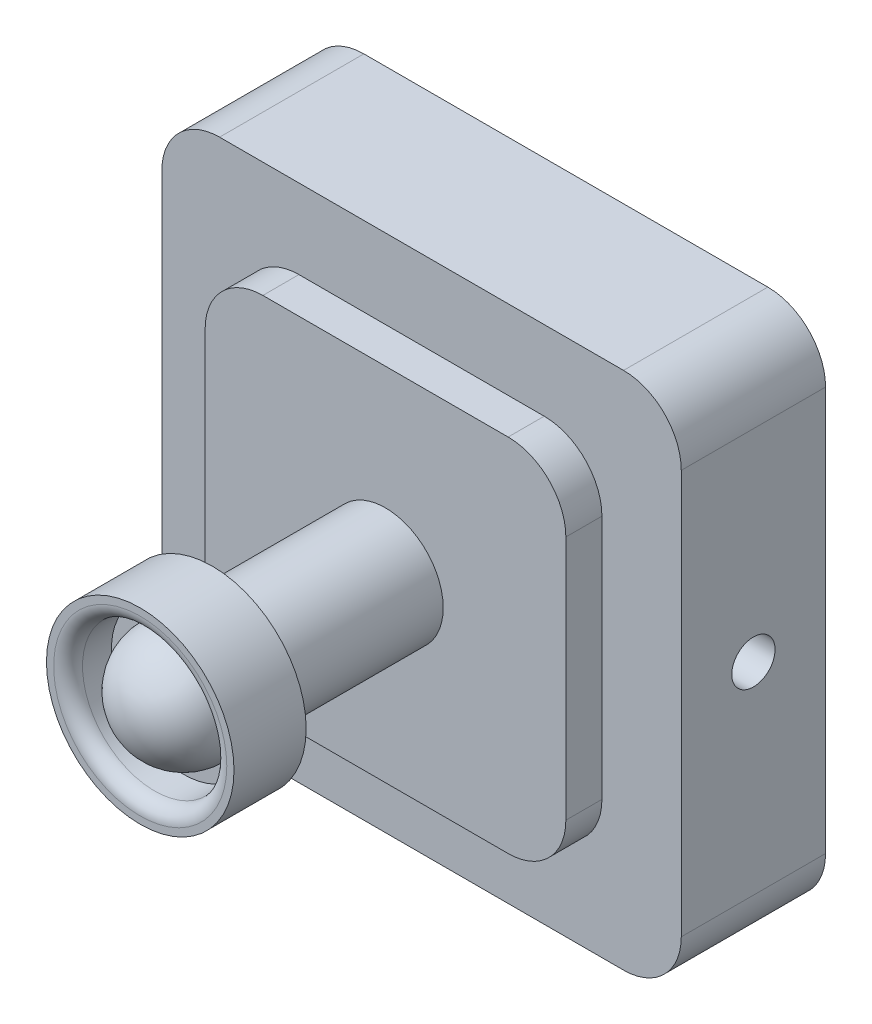
ISO-10303-21;
HEADER;
FILE_DESCRIPTION(('STEP AP214'),'2;1');
FILE_NAME('part.step','',(''),(''),'','','');
FILE_SCHEMA(('AUTOMOTIVE_DESIGN { 1 0 10303 214 1 1 1 1 }'));
ENDSEC;
DATA;
#1=APPLICATION_CONTEXT('core data for automotive mechanical design processes');
#2=APPLICATION_PROTOCOL_DEFINITION('international standard','automotive_design',2000,#1);
#3=PRODUCT_CONTEXT('',#1,'mechanical');
#4=PRODUCT('Part','Part','',(#3));
#5=PRODUCT_RELATED_PRODUCT_CATEGORY('part','',(#4));
#6=PRODUCT_DEFINITION_FORMATION('','',#4);
#7=PRODUCT_DEFINITION_CONTEXT('part definition',#1,'design');
#8=PRODUCT_DEFINITION('design','',#6,#7);
#9=PRODUCT_DEFINITION_SHAPE('','',#8);
#10=(LENGTH_UNIT() NAMED_UNIT(*) SI_UNIT(.MILLI.,.METRE.));
#11=(NAMED_UNIT(*) PLANE_ANGLE_UNIT() SI_UNIT($,.RADIAN.));
#12=(NAMED_UNIT(*) SI_UNIT($,.STERADIAN.) SOLID_ANGLE_UNIT());
#13=UNCERTAINTY_MEASURE_WITH_UNIT(LENGTH_MEASURE(1.E-05),#10,'distance_accuracy_value','');
#14=(GEOMETRIC_REPRESENTATION_CONTEXT(3) GLOBAL_UNCERTAINTY_ASSIGNED_CONTEXT((#13)) GLOBAL_UNIT_ASSIGNED_CONTEXT((#10,
#11,#12)) REPRESENTATION_CONTEXT('',''));
#15=CARTESIAN_POINT('',(0.,0.,0.));
#16=DIRECTION('',(0.,0.,1.));
#17=DIRECTION('',(1.,0.,0.));
#18=AXIS2_PLACEMENT_3D('',#15,#16,#17);
#19=CARTESIAN_POINT('',(0.,0.,10.));
#20=DIRECTION('',(0.,0.,-1.));
#21=DIRECTION('',(-1.,0.,0.));
#22=AXIS2_PLACEMENT_3D('',#19,#20,#21);
#23=PLANE('',#22);
#24=DIRECTION('',(-1.,0.,0.));
#25=VECTOR('',#24,1.);
#26=CARTESIAN_POINT('',(0.,36.,10.));
#27=LINE('',#26,#25);
#28=CARTESIAN_POINT('',(32.,36.,10.));
#29=VERTEX_POINT('',#28);
#30=CARTESIAN_POINT('',(4.,36.,10.));
#31=VERTEX_POINT('',#30);
#32=EDGE_CURVE('E195',#29,#31,#27,.T.);
#33=ORIENTED_EDGE('',*,*,#32,.T.);
#34=CARTESIAN_POINT('',(4.,32.,10.));
#35=DIRECTION('',(0.,0.,-1.));
#36=DIRECTION('',(-1.,0.,0.));
#37=AXIS2_PLACEMENT_3D('',#34,#35,#36);
#38=CIRCLE('',#37,4.);
#39=CARTESIAN_POINT('',(0.,32.,10.));
#40=VERTEX_POINT('',#39);
#41=EDGE_CURVE('E263',#31,#40,#38,.F.);
#42=ORIENTED_EDGE('',*,*,#41,.T.);
#43=DIRECTION('',(0.,-1.,0.));
#44=VECTOR('',#43,1.);
#45=CARTESIAN_POINT('',(0.,0.,10.));
#46=LINE('',#45,#44);
#47=CARTESIAN_POINT('',(0.,4.,10.));
#48=VERTEX_POINT('',#47);
#49=EDGE_CURVE('E187',#40,#48,#46,.T.);
#50=ORIENTED_EDGE('',*,*,#49,.T.);
#51=CARTESIAN_POINT('',(4.,4.,10.));
#52=DIRECTION('',(0.,0.,-1.));
#53=DIRECTION('',(-1.,0.,0.));
#54=AXIS2_PLACEMENT_3D('',#51,#52,#53);
#55=CIRCLE('',#54,4.);
#56=CARTESIAN_POINT('',(4.,0.,10.));
#57=VERTEX_POINT('',#56);
#58=EDGE_CURVE('E258',#48,#57,#55,.F.);
#59=ORIENTED_EDGE('',*,*,#58,.T.);
#60=DIRECTION('',(1.,0.,0.));
#61=VECTOR('',#60,1.);
#62=CARTESIAN_POINT('',(0.,0.,10.));
#63=LINE('',#62,#61);
#64=CARTESIAN_POINT('',(32.,0.,10.));
#65=VERTEX_POINT('',#64);
#66=EDGE_CURVE('E190',#57,#65,#63,.T.);
#67=ORIENTED_EDGE('',*,*,#66,.T.);
#68=CARTESIAN_POINT('',(32.,4.,10.));
#69=DIRECTION('',(0.,0.,-1.));
#70=DIRECTION('',(-1.,0.,0.));
#71=AXIS2_PLACEMENT_3D('',#68,#69,#70);
#72=CIRCLE('',#71,4.);
#73=CARTESIAN_POINT('',(36.,4.,10.));
#74=VERTEX_POINT('',#73);
#75=EDGE_CURVE('E57',#65,#74,#72,.F.);
#76=ORIENTED_EDGE('',*,*,#75,.T.);
#77=DIRECTION('',(0.,1.,0.));
#78=VECTOR('',#77,1.);
#79=CARTESIAN_POINT('',(36.,0.,10.));
#80=LINE('',#79,#78);
#81=CARTESIAN_POINT('',(36.,32.,10.));
#82=VERTEX_POINT('',#81);
#83=EDGE_CURVE('E193',#74,#82,#80,.T.);
#84=ORIENTED_EDGE('',*,*,#83,.T.);
#85=CARTESIAN_POINT('',(32.,32.,10.));
#86=DIRECTION('',(0.,0.,-1.));
#87=DIRECTION('',(-1.,0.,0.));
#88=AXIS2_PLACEMENT_3D('',#85,#86,#87);
#89=CIRCLE('',#88,4.);
#90=EDGE_CURVE('E261',#82,#29,#89,.F.);
#91=ORIENTED_EDGE('',*,*,#90,.T.);
#92=EDGE_LOOP('',(#33,#42,#50,#59,#67,#76,#84,#91));
#93=FACE_BOUND('',#92,.T.);
#94=DIRECTION('',(0.,1.,0.));
#95=VECTOR('',#94,1.);
#96=CARTESIAN_POINT('',(30.5,30.5,10.));
#97=LINE('',#96,#95);
#98=CARTESIAN_POINT('',(30.5,9.50000000000001,10.));
#99=VERTEX_POINT('',#98);
#100=CARTESIAN_POINT('',(30.5,26.5,10.));
#101=VERTEX_POINT('',#100);
#102=EDGE_CURVE('E183',#99,#101,#97,.T.);
#103=ORIENTED_EDGE('',*,*,#102,.F.);
#104=CARTESIAN_POINT('',(26.5,9.50000000000001,10.));
#105=DIRECTION('',(0.,0.,-1.));
#106=DIRECTION('',(-1.,0.,0.));
#107=AXIS2_PLACEMENT_3D('',#104,#105,#106);
#108=CIRCLE('',#107,4.);
#109=CARTESIAN_POINT('',(26.5,5.50000000000001,10.));
#110=VERTEX_POINT('',#109);
#111=EDGE_CURVE('E238',#99,#110,#108,.T.);
#112=ORIENTED_EDGE('',*,*,#111,.T.);
#113=DIRECTION('',(1.,0.,0.));
#114=VECTOR('',#113,1.);
#115=CARTESIAN_POINT('',(5.5,5.50000000000001,10.));
#116=LINE('',#115,#114);
#117=CARTESIAN_POINT('',(9.50000000000001,5.50000000000001,10.));
#118=VERTEX_POINT('',#117);
#119=EDGE_CURVE('E177',#118,#110,#116,.T.);
#120=ORIENTED_EDGE('',*,*,#119,.F.);
#121=CARTESIAN_POINT('',(9.50000000000001,9.50000000000001,10.));
#122=DIRECTION('',(0.,0.,-1.));
#123=DIRECTION('',(-1.,0.,0.));
#124=AXIS2_PLACEMENT_3D('',#121,#122,#123);
#125=CIRCLE('',#124,4.);
#126=CARTESIAN_POINT('',(5.5,9.50000000000001,10.));
#127=VERTEX_POINT('',#126);
#128=EDGE_CURVE('E176',#118,#127,#125,.T.);
#129=ORIENTED_EDGE('',*,*,#128,.T.);
#130=DIRECTION('',(0.,-1.,0.));
#131=VECTOR('',#130,1.);
#132=CARTESIAN_POINT('',(5.5,30.5,10.));
#133=LINE('',#132,#131);
#134=CARTESIAN_POINT('',(5.5,26.5,10.));
#135=VERTEX_POINT('',#134);
#136=EDGE_CURVE('E167',#135,#127,#133,.T.);
#137=ORIENTED_EDGE('',*,*,#136,.F.);
#138=CARTESIAN_POINT('',(9.5,26.5,10.));
#139=DIRECTION('',(0.,0.,-1.));
#140=DIRECTION('',(-1.,0.,0.));
#141=AXIS2_PLACEMENT_3D('',#138,#139,#140);
#142=CIRCLE('',#141,4.);
#143=CARTESIAN_POINT('',(9.5,30.5,10.));
#144=VERTEX_POINT('',#143);
#145=EDGE_CURVE('E150',#135,#144,#142,.T.);
#146=ORIENTED_EDGE('',*,*,#145,.T.);
#147=DIRECTION('',(-1.,0.,0.));
#148=VECTOR('',#147,1.);
#149=CARTESIAN_POINT('',(5.5,30.5,10.));
#150=LINE('',#149,#148);
#151=CARTESIAN_POINT('',(26.5,30.5,10.));
#152=VERTEX_POINT('',#151);
#153=EDGE_CURVE('E178',#152,#144,#150,.T.);
#154=ORIENTED_EDGE('',*,*,#153,.F.);
#155=CARTESIAN_POINT('',(26.5,26.5,10.));
#156=DIRECTION('',(0.,0.,-1.));
#157=DIRECTION('',(-1.,0.,0.));
#158=AXIS2_PLACEMENT_3D('',#155,#156,#157);
#159=CIRCLE('',#158,4.);
#160=EDGE_CURVE('E160',#152,#101,#159,.T.);
#161=ORIENTED_EDGE('',*,*,#160,.T.);
#162=EDGE_LOOP('',(#103,#112,#120,#129,#137,#146,#154,#161));
#163=FACE_BOUND('',#162,.T.);
#164=ADVANCED_FACE('F35',(#93,#163),#23,.F.);
#165=CARTESIAN_POINT('',(0.,0.,10.));
#166=DIRECTION('',(1.,0.,0.));
#167=DIRECTION('',(0.,0.,-1.));
#168=AXIS2_PLACEMENT_3D('',#165,#166,#167);
#169=PLANE('',#168);
#170=CARTESIAN_POINT('',(0.,18.,5.));
#171=DIRECTION('',(-1.,0.,0.));
#172=DIRECTION('',(0.,0.,1.));
#173=AXIS2_PLACEMENT_3D('',#170,#171,#172);
#174=CIRCLE('',#173,1.5);
#175=CARTESIAN_POINT('',(0.,18.,6.5));
#176=VERTEX_POINT('',#175);
#177=EDGE_CURVE('E462',#176,#176,#174,.T.);
#178=ORIENTED_EDGE('',*,*,#177,.F.);
#179=EDGE_LOOP('',(#178));
#180=FACE_BOUND('',#179,.T.);
#181=ORIENTED_EDGE('',*,*,#49,.F.);
#182=DIRECTION('',(0.,0.,-1.));
#183=VECTOR('',#182,1.);
#184=CARTESIAN_POINT('',(0.,32.,10.));
#185=LINE('',#184,#183);
#186=CARTESIAN_POINT('',(0.,32.,0.));
#187=VERTEX_POINT('',#186);
#188=EDGE_CURVE('E242',#40,#187,#185,.T.);
#189=ORIENTED_EDGE('',*,*,#188,.T.);
#190=DIRECTION('',(0.,-1.,0.));
#191=VECTOR('',#190,1.);
#192=CARTESIAN_POINT('',(0.,0.,0.));
#193=LINE('',#192,#191);
#194=CARTESIAN_POINT('',(0.,4.,0.));
#195=VERTEX_POINT('',#194);
#196=EDGE_CURVE('E199',#187,#195,#193,.T.);
#197=ORIENTED_EDGE('',*,*,#196,.T.);
#198=DIRECTION('',(0.,0.,-1.));
#199=VECTOR('',#198,1.);
#200=CARTESIAN_POINT('',(0.,4.,10.));
#201=LINE('',#200,#199);
#202=EDGE_CURVE('E240',#195,#48,#201,.F.);
#203=ORIENTED_EDGE('',*,*,#202,.T.);
#204=EDGE_LOOP('',(#181,#189,#197,#203));
#205=FACE_BOUND('',#204,.T.);
#206=ADVANCED_FACE('F290',(#180,#205),#169,.F.);
#207=CARTESIAN_POINT('',(0.,0.,10.));
#208=DIRECTION('',(0.,1.,0.));
#209=DIRECTION('',(0.,0.,1.));
#210=AXIS2_PLACEMENT_3D('',#207,#208,#209);
#211=PLANE('',#210);
#212=DIRECTION('',(1.,0.,0.));
#213=VECTOR('',#212,1.);
#214=CARTESIAN_POINT('',(0.,0.,0.));
#215=LINE('',#214,#213);
#216=CARTESIAN_POINT('',(4.,0.,0.));
#217=VERTEX_POINT('',#216);
#218=CARTESIAN_POINT('',(32.,0.,0.));
#219=VERTEX_POINT('',#218);
#220=EDGE_CURVE('E202',#217,#219,#215,.T.);
#221=ORIENTED_EDGE('',*,*,#220,.T.);
#222=DIRECTION('',(0.,0.,-1.));
#223=VECTOR('',#222,1.);
#224=CARTESIAN_POINT('',(32.,0.,10.));
#225=LINE('',#224,#223);
#226=EDGE_CURVE('E272',#219,#65,#225,.F.);
#227=ORIENTED_EDGE('',*,*,#226,.T.);
#228=ORIENTED_EDGE('',*,*,#66,.F.);
#229=DIRECTION('',(0.,0.,-1.));
#230=VECTOR('',#229,1.);
#231=CARTESIAN_POINT('',(4.,0.,10.));
#232=LINE('',#231,#230);
#233=EDGE_CURVE('E269',#57,#217,#232,.T.);
#234=ORIENTED_EDGE('',*,*,#233,.T.);
#235=EDGE_LOOP('',(#221,#227,#228,#234));
#236=FACE_BOUND('',#235,.T.);
#237=ADVANCED_FACE('F295',(#236),#211,.F.);
#238=CARTESIAN_POINT('',(36.,0.,10.));
#239=DIRECTION('',(-1.,0.,0.));
#240=DIRECTION('',(0.,0.,1.));
#241=AXIS2_PLACEMENT_3D('',#238,#239,#240);
#242=PLANE('',#241);
#243=CARTESIAN_POINT('',(36.,18.,5.));
#244=DIRECTION('',(1.,0.,0.));
#245=DIRECTION('',(0.,0.,-1.));
#246=AXIS2_PLACEMENT_3D('',#243,#244,#245);
#247=CIRCLE('',#246,1.5);
#248=CARTESIAN_POINT('',(36.,18.,3.5));
#249=VERTEX_POINT('',#248);
#250=EDGE_CURVE('E456',#249,#249,#247,.T.);
#251=ORIENTED_EDGE('',*,*,#250,.F.);
#252=EDGE_LOOP('',(#251));
#253=FACE_BOUND('',#252,.T.);
#254=DIRECTION('',(0.,1.,0.));
#255=VECTOR('',#254,1.);
#256=CARTESIAN_POINT('',(36.,0.,0.));
#257=LINE('',#256,#255);
#258=CARTESIAN_POINT('',(36.,4.,0.));
#259=VERTEX_POINT('',#258);
#260=CARTESIAN_POINT('',(36.,32.,0.));
#261=VERTEX_POINT('',#260);
#262=EDGE_CURVE('E206',#259,#261,#257,.T.);
#263=ORIENTED_EDGE('',*,*,#262,.T.);
#264=DIRECTION('',(0.,0.,-1.));
#265=VECTOR('',#264,1.);
#266=CARTESIAN_POINT('',(36.,32.,10.));
#267=LINE('',#266,#265);
#268=EDGE_CURVE('E50',#261,#82,#267,.F.);
#269=ORIENTED_EDGE('',*,*,#268,.T.);
#270=ORIENTED_EDGE('',*,*,#83,.F.);
#271=DIRECTION('',(0.,0.,-1.));
#272=VECTOR('',#271,1.);
#273=CARTESIAN_POINT('',(36.,4.,10.));
#274=LINE('',#273,#272);
#275=EDGE_CURVE('E265',#74,#259,#274,.T.);
#276=ORIENTED_EDGE('',*,*,#275,.T.);
#277=EDGE_LOOP('',(#263,#269,#270,#276));
#278=FACE_BOUND('',#277,.T.);
#279=ADVANCED_FACE('F309',(#253,#278),#242,.F.);
#280=CARTESIAN_POINT('',(0.,36.,10.));
#281=DIRECTION('',(0.,-1.,0.));
#282=DIRECTION('',(1.,0.,0.));
#283=AXIS2_PLACEMENT_3D('',#280,#281,#282);
#284=PLANE('',#283);
#285=DIRECTION('',(-1.,0.,0.));
#286=VECTOR('',#285,1.);
#287=CARTESIAN_POINT('',(0.,36.,0.));
#288=LINE('',#287,#286);
#289=CARTESIAN_POINT('',(32.,36.,0.));
#290=VERTEX_POINT('',#289);
#291=CARTESIAN_POINT('',(4.,36.,0.));
#292=VERTEX_POINT('',#291);
#293=EDGE_CURVE('E191',#290,#292,#288,.T.);
#294=ORIENTED_EDGE('',*,*,#293,.T.);
#295=DIRECTION('',(0.,0.,-1.));
#296=VECTOR('',#295,1.);
#297=CARTESIAN_POINT('',(4.,36.,10.));
#298=LINE('',#297,#296);
#299=EDGE_CURVE('E256',#292,#31,#298,.F.);
#300=ORIENTED_EDGE('',*,*,#299,.T.);
#301=ORIENTED_EDGE('',*,*,#32,.F.);
#302=DIRECTION('',(0.,0.,-1.));
#303=VECTOR('',#302,1.);
#304=CARTESIAN_POINT('',(32.,36.,10.));
#305=LINE('',#304,#303);
#306=EDGE_CURVE('E253',#29,#290,#305,.T.);
#307=ORIENTED_EDGE('',*,*,#306,.T.);
#308=EDGE_LOOP('',(#294,#300,#301,#307));
#309=FACE_BOUND('',#308,.T.);
#310=ADVANCED_FACE('F305',(#309),#284,.F.);
#311=CARTESIAN_POINT('',(0.,0.,0.));
#312=DIRECTION('',(0.,0.,-1.));
#313=DIRECTION('',(-1.,0.,0.));
#314=AXIS2_PLACEMENT_3D('',#311,#312,#313);
#315=PLANE('',#314);
#316=ORIENTED_EDGE('',*,*,#196,.F.);
#317=CARTESIAN_POINT('',(4.,32.,0.));
#318=DIRECTION('',(0.,0.,-1.));
#319=DIRECTION('',(-1.,0.,0.));
#320=AXIS2_PLACEMENT_3D('',#317,#318,#319);
#321=CIRCLE('',#320,4.);
#322=EDGE_CURVE('E251',#187,#292,#321,.T.);
#323=ORIENTED_EDGE('',*,*,#322,.T.);
#324=ORIENTED_EDGE('',*,*,#293,.F.);
#325=CARTESIAN_POINT('',(32.,32.,0.));
#326=DIRECTION('',(0.,0.,-1.));
#327=DIRECTION('',(-1.,0.,0.));
#328=AXIS2_PLACEMENT_3D('',#325,#326,#327);
#329=CIRCLE('',#328,4.);
#330=EDGE_CURVE('E249',#290,#261,#329,.T.);
#331=ORIENTED_EDGE('',*,*,#330,.T.);
#332=ORIENTED_EDGE('',*,*,#262,.F.);
#333=CARTESIAN_POINT('',(32.,4.,0.));
#334=DIRECTION('',(0.,0.,-1.));
#335=DIRECTION('',(-1.,0.,0.));
#336=AXIS2_PLACEMENT_3D('',#333,#334,#335);
#337=CIRCLE('',#336,4.);
#338=EDGE_CURVE('E247',#259,#219,#337,.T.);
#339=ORIENTED_EDGE('',*,*,#338,.T.);
#340=ORIENTED_EDGE('',*,*,#220,.F.);
#341=CARTESIAN_POINT('',(4.,4.,0.));
#342=DIRECTION('',(0.,0.,-1.));
#343=DIRECTION('',(-1.,0.,0.));
#344=AXIS2_PLACEMENT_3D('',#341,#342,#343);
#345=CIRCLE('',#344,4.);
#346=EDGE_CURVE('E245',#217,#195,#345,.T.);
#347=ORIENTED_EDGE('',*,*,#346,.T.);
#348=EDGE_LOOP('',(#316,#323,#324,#331,#332,#339,#340,#347));
#349=FACE_BOUND('',#348,.T.);
#350=ADVANCED_FACE('F302',(#349),#315,.T.);
#351=CARTESIAN_POINT('',(30.5,30.5,12.5));
#352=DIRECTION('',(-1.,0.,0.));
#353=DIRECTION('',(0.,-1.,0.));
#354=AXIS2_PLACEMENT_3D('',#351,#352,#353);
#355=PLANE('',#354);
#356=ORIENTED_EDGE('',*,*,#102,.T.);
#357=DIRECTION('',(0.,0.,-1.));
#358=VECTOR('',#357,1.);
#359=CARTESIAN_POINT('',(30.5,26.5,12.5));
#360=LINE('',#359,#358);
#361=CARTESIAN_POINT('',(30.5,26.5,12.5));
#362=VERTEX_POINT('',#361);
#363=EDGE_CURVE('E230',#101,#362,#360,.F.);
#364=ORIENTED_EDGE('',*,*,#363,.T.);
#365=DIRECTION('',(0.,1.,0.));
#366=VECTOR('',#365,1.);
#367=CARTESIAN_POINT('',(30.5,30.5,12.5));
#368=LINE('',#367,#366);
#369=CARTESIAN_POINT('',(30.5,9.50000000000001,12.5));
#370=VERTEX_POINT('',#369);
#371=EDGE_CURVE('E181',#370,#362,#368,.T.);
#372=ORIENTED_EDGE('',*,*,#371,.F.);
#373=DIRECTION('',(0.,0.,-1.));
#374=VECTOR('',#373,1.);
#375=CARTESIAN_POINT('',(30.5,9.50000000000001,12.5));
#376=LINE('',#375,#374);
#377=EDGE_CURVE('E227',#370,#99,#376,.T.);
#378=ORIENTED_EDGE('',*,*,#377,.T.);
#379=EDGE_LOOP('',(#356,#364,#372,#378));
#380=FACE_BOUND('',#379,.T.);
#381=ADVANCED_FACE('F300',(#380),#355,.F.);
#382=CARTESIAN_POINT('',(5.5,30.5,12.5));
#383=DIRECTION('',(0.,-1.,0.));
#384=DIRECTION('',(0.,0.,-1.));
#385=AXIS2_PLACEMENT_3D('',#382,#383,#384);
#386=PLANE('',#385);
#387=ORIENTED_EDGE('',*,*,#153,.T.);
#388=DIRECTION('',(0.,0.,-1.));
#389=VECTOR('',#388,1.);
#390=CARTESIAN_POINT('',(9.5,30.5,12.5));
#391=LINE('',#390,#389);
#392=CARTESIAN_POINT('',(9.5,30.5,12.5));
#393=VERTEX_POINT('',#392);
#394=EDGE_CURVE('E155',#144,#393,#391,.F.);
#395=ORIENTED_EDGE('',*,*,#394,.T.);
#396=DIRECTION('',(-1.,0.,0.));
#397=VECTOR('',#396,1.);
#398=CARTESIAN_POINT('',(5.5,30.5,12.5));
#399=LINE('',#398,#397);
#400=CARTESIAN_POINT('',(26.5,30.5,12.5));
#401=VERTEX_POINT('',#400);
#402=EDGE_CURVE('E432',#401,#393,#399,.T.);
#403=ORIENTED_EDGE('',*,*,#402,.F.);
#404=DIRECTION('',(0.,0.,-1.));
#405=VECTOR('',#404,1.);
#406=CARTESIAN_POINT('',(26.5,30.5,12.5));
#407=LINE('',#406,#405);
#408=EDGE_CURVE('E171',#401,#152,#407,.T.);
#409=ORIENTED_EDGE('',*,*,#408,.T.);
#410=EDGE_LOOP('',(#387,#395,#403,#409));
#411=FACE_BOUND('',#410,.T.);
#412=ADVANCED_FACE('F414',(#411),#386,.F.);
#413=CARTESIAN_POINT('',(5.5,30.5,12.5));
#414=DIRECTION('',(1.,0.,0.));
#415=DIRECTION('',(0.,1.,0.));
#416=AXIS2_PLACEMENT_3D('',#413,#414,#415);
#417=PLANE('',#416);
#418=DIRECTION('',(0.,-1.,0.));
#419=VECTOR('',#418,1.);
#420=CARTESIAN_POINT('',(5.5,30.5,12.5));
#421=LINE('',#420,#419);
#422=CARTESIAN_POINT('',(5.5,26.5,12.5));
#423=VERTEX_POINT('',#422);
#424=CARTESIAN_POINT('',(5.5,9.50000000000001,12.5));
#425=VERTEX_POINT('',#424);
#426=EDGE_CURVE('E170',#423,#425,#421,.T.);
#427=ORIENTED_EDGE('',*,*,#426,.F.);
#428=DIRECTION('',(0.,0.,-1.));
#429=VECTOR('',#428,1.);
#430=CARTESIAN_POINT('',(5.5,26.5,12.5));
#431=LINE('',#430,#429);
#432=EDGE_CURVE('E154',#423,#135,#431,.T.);
#433=ORIENTED_EDGE('',*,*,#432,.T.);
#434=ORIENTED_EDGE('',*,*,#136,.T.);
#435=DIRECTION('',(0.,0.,-1.));
#436=VECTOR('',#435,1.);
#437=CARTESIAN_POINT('',(5.5,9.50000000000001,12.5));
#438=LINE('',#437,#436);
#439=EDGE_CURVE('E172',#127,#425,#438,.F.);
#440=ORIENTED_EDGE('',*,*,#439,.T.);
#441=EDGE_LOOP('',(#427,#433,#434,#440));
#442=FACE_BOUND('',#441,.T.);
#443=ADVANCED_FACE('F166',(#442),#417,.F.);
#444=CARTESIAN_POINT('',(5.5,5.50000000000001,12.5));
#445=DIRECTION('',(0.,1.,0.));
#446=DIRECTION('',(0.,0.,1.));
#447=AXIS2_PLACEMENT_3D('',#444,#445,#446);
#448=PLANE('',#447);
#449=DIRECTION('',(1.,0.,0.));
#450=VECTOR('',#449,1.);
#451=CARTESIAN_POINT('',(5.5,5.50000000000001,12.5));
#452=LINE('',#451,#450);
#453=CARTESIAN_POINT('',(9.50000000000001,5.50000000000001,12.5));
#454=VERTEX_POINT('',#453);
#455=CARTESIAN_POINT('',(26.5,5.50000000000001,12.5));
#456=VERTEX_POINT('',#455);
#457=EDGE_CURVE('E203',#454,#456,#452,.T.);
#458=ORIENTED_EDGE('',*,*,#457,.F.);
#459=DIRECTION('',(0.,0.,-1.));
#460=VECTOR('',#459,1.);
#461=CARTESIAN_POINT('',(9.50000000000001,5.50000000000001,12.5));
#462=LINE('',#461,#460);
#463=EDGE_CURVE('E161',#454,#118,#462,.T.);
#464=ORIENTED_EDGE('',*,*,#463,.T.);
#465=ORIENTED_EDGE('',*,*,#119,.T.);
#466=DIRECTION('',(0.,0.,-1.));
#467=VECTOR('',#466,1.);
#468=CARTESIAN_POINT('',(26.5,5.50000000000001,12.5));
#469=LINE('',#468,#467);
#470=EDGE_CURVE('E232',#110,#456,#469,.F.);
#471=ORIENTED_EDGE('',*,*,#470,.T.);
#472=EDGE_LOOP('',(#458,#464,#465,#471));
#473=FACE_BOUND('',#472,.T.);
#474=ADVANCED_FACE('F408',(#473),#448,.F.);
#475=CARTESIAN_POINT('',(0.,0.,12.5));
#476=DIRECTION('',(0.,0.,1.));
#477=DIRECTION('',(1.,0.,0.));
#478=AXIS2_PLACEMENT_3D('',#475,#476,#477);
#479=PLANE('',#478);
#480=CARTESIAN_POINT('',(18.,18.,12.5));
#481=DIRECTION('',(0.,0.,1.));
#482=DIRECTION('',(1.,0.,0.));
#483=AXIS2_PLACEMENT_3D('',#480,#481,#482);
#484=CIRCLE('',#483,4.);
#485=CARTESIAN_POINT('',(22.,18.,12.5));
#486=VERTEX_POINT('',#485);
#487=EDGE_CURVE('E198',#486,#486,#484,.T.);
#488=ORIENTED_EDGE('',*,*,#487,.F.);
#489=EDGE_LOOP('',(#488));
#490=FACE_BOUND('',#489,.T.);
#491=ORIENTED_EDGE('',*,*,#402,.T.);
#492=CARTESIAN_POINT('',(9.5,26.5,12.5));
#493=DIRECTION('',(0.,0.,1.));
#494=DIRECTION('',(1.,0.,0.));
#495=AXIS2_PLACEMENT_3D('',#492,#493,#494);
#496=CIRCLE('',#495,4.);
#497=EDGE_CURVE('E225',#393,#423,#496,.T.);
#498=ORIENTED_EDGE('',*,*,#497,.T.);
#499=ORIENTED_EDGE('',*,*,#426,.T.);
#500=CARTESIAN_POINT('',(9.50000000000001,9.50000000000001,12.5));
#501=DIRECTION('',(0.,0.,1.));
#502=DIRECTION('',(1.,0.,0.));
#503=AXIS2_PLACEMENT_3D('',#500,#501,#502);
#504=CIRCLE('',#503,4.);
#505=EDGE_CURVE('E221',#425,#454,#504,.T.);
#506=ORIENTED_EDGE('',*,*,#505,.T.);
#507=ORIENTED_EDGE('',*,*,#457,.T.);
#508=CARTESIAN_POINT('',(26.5,9.50000000000001,12.5));
#509=DIRECTION('',(0.,0.,1.));
#510=DIRECTION('',(1.,0.,0.));
#511=AXIS2_PLACEMENT_3D('',#508,#509,#510);
#512=CIRCLE('',#511,4.);
#513=EDGE_CURVE('E219',#456,#370,#512,.T.);
#514=ORIENTED_EDGE('',*,*,#513,.T.);
#515=ORIENTED_EDGE('',*,*,#371,.T.);
#516=CARTESIAN_POINT('',(26.5,26.5,12.5));
#517=DIRECTION('',(0.,0.,1.));
#518=DIRECTION('',(1.,0.,0.));
#519=AXIS2_PLACEMENT_3D('',#516,#517,#518);
#520=CIRCLE('',#519,4.);
#521=EDGE_CURVE('E223',#362,#401,#520,.T.);
#522=ORIENTED_EDGE('',*,*,#521,.T.);
#523=EDGE_LOOP('',(#491,#498,#499,#506,#507,#514,#515,#522));
#524=FACE_BOUND('',#523,.T.);
#525=ADVANCED_FACE('F404',(#490,#524),#479,.T.);
#526=CARTESIAN_POINT('',(18.,18.,24.5));
#527=DIRECTION('',(0.,0.,-1.));
#528=DIRECTION('',(-1.,0.,0.));
#529=AXIS2_PLACEMENT_3D('',#526,#527,#528);
#530=CYLINDRICAL_SURFACE('',#529,4.);
#531=CARTESIAN_POINT('',(18.,18.,24.5));
#532=DIRECTION('',(0.,0.,1.));
#533=DIRECTION('',(1.,0.,0.));
#534=AXIS2_PLACEMENT_3D('',#531,#532,#533);
#535=CIRCLE('',#534,4.);
#536=CARTESIAN_POINT('',(22.,18.,24.5));
#537=VERTEX_POINT('',#536);
#538=EDGE_CURVE('E429',#537,#537,#535,.T.);
#539=ORIENTED_EDGE('',*,*,#538,.F.);
#540=EDGE_LOOP('',(#539));
#541=FACE_BOUND('',#540,.T.);
#542=ORIENTED_EDGE('',*,*,#487,.T.);
#543=EDGE_LOOP('',(#542));
#544=FACE_BOUND('',#543,.T.);
#545=ADVANCED_FACE('F400',(#541,#544),#530,.T.);
#546=CARTESIAN_POINT('',(18.,18.,29.5));
#547=DIRECTION('',(0.,0.,-1.));
#548=DIRECTION('',(-1.,0.,0.));
#549=AXIS2_PLACEMENT_3D('',#546,#547,#548);
#550=CYLINDRICAL_SURFACE('',#549,6.5);
#551=CARTESIAN_POINT('',(18.,18.,29.5));
#552=DIRECTION('',(0.,0.,1.));
#553=DIRECTION('',(1.,0.,0.));
#554=AXIS2_PLACEMENT_3D('',#551,#552,#553);
#555=CIRCLE('',#554,6.5);
#556=CARTESIAN_POINT('',(24.5,18.,29.5));
#557=VERTEX_POINT('',#556);
#558=EDGE_CURVE('E448',#557,#557,#555,.T.);
#559=ORIENTED_EDGE('',*,*,#558,.F.);
#560=EDGE_LOOP('',(#559));
#561=FACE_BOUND('',#560,.T.);
#562=CARTESIAN_POINT('',(18.,18.,24.5));
#563=DIRECTION('',(0.,0.,1.));
#564=DIRECTION('',(1.,0.,0.));
#565=AXIS2_PLACEMENT_3D('',#562,#563,#564);
#566=CIRCLE('',#565,6.5);
#567=CARTESIAN_POINT('',(24.5,18.,24.5));
#568=VERTEX_POINT('',#567);
#569=EDGE_CURVE('E449',#568,#568,#566,.T.);
#570=ORIENTED_EDGE('',*,*,#569,.T.);
#571=EDGE_LOOP('',(#570));
#572=FACE_BOUND('',#571,.T.);
#573=ADVANCED_FACE('F393',(#561,#572),#550,.T.);
#574=CARTESIAN_POINT('',(18.,18.,29.5));
#575=DIRECTION('',(0.,0.,1.));
#576=DIRECTION('',(1.,0.,0.));
#577=AXIS2_PLACEMENT_3D('',#574,#575,#576);
#578=PLANE('',#577);
#579=CARTESIAN_POINT('',(18.,18.,29.5));
#580=DIRECTION('',(0.,0.,1.));
#581=DIRECTION('',(1.,0.,0.));
#582=AXIS2_PLACEMENT_3D('',#579,#580,#581);
#583=CIRCLE('',#582,6.);
#584=CARTESIAN_POINT('',(24.,18.,29.5));
#585=VERTEX_POINT('',#584);
#586=EDGE_CURVE('E11',#585,#585,#583,.F.);
#587=ORIENTED_EDGE('',*,*,#586,.T.);
#588=EDGE_LOOP('',(#587));
#589=FACE_BOUND('',#588,.T.);
#590=ORIENTED_EDGE('',*,*,#558,.T.);
#591=EDGE_LOOP('',(#590));
#592=FACE_BOUND('',#591,.T.);
#593=ADVANCED_FACE('F390',(#589,#592),#578,.T.);
#594=CARTESIAN_POINT('',(18.,18.,24.5));
#595=DIRECTION('',(0.,0.,1.));
#596=DIRECTION('',(1.,0.,0.));
#597=AXIS2_PLACEMENT_3D('',#594,#595,#596);
#598=PLANE('',#597);
#599=ORIENTED_EDGE('',*,*,#538,.T.);
#600=EDGE_LOOP('',(#599));
#601=FACE_BOUND('',#600,.T.);
#602=ORIENTED_EDGE('',*,*,#569,.F.);
#603=EDGE_LOOP('',(#602));
#604=FACE_BOUND('',#603,.T.);
#605=ADVANCED_FACE('F389',(#601,#604),#598,.F.);
#606=CARTESIAN_POINT('',(18.,18.,26.5));
#607=DIRECTION('',(0.,0.,1.));
#608=DIRECTION('',(1.,0.,0.));
#609=AXIS2_PLACEMENT_3D('',#606,#607,#608);
#610=CYLINDRICAL_SURFACE('',#609,5.);
#611=CARTESIAN_POINT('',(18.,18.,28.5));
#612=DIRECTION('',(0.,0.,1.));
#613=DIRECTION('',(1.,0.,0.));
#614=AXIS2_PLACEMENT_3D('',#611,#612,#613);
#615=CIRCLE('',#614,5.);
#616=CARTESIAN_POINT('',(23.,18.,28.5));
#617=VERTEX_POINT('',#616);
#618=EDGE_CURVE('E43',#617,#617,#615,.T.);
#619=ORIENTED_EDGE('',*,*,#618,.T.);
#620=EDGE_LOOP('',(#619));
#621=FACE_BOUND('',#620,.T.);
#622=CARTESIAN_POINT('',(18.,18.,26.5));
#623=DIRECTION('',(0.,0.,1.));
#624=DIRECTION('',(1.,0.,0.));
#625=AXIS2_PLACEMENT_3D('',#622,#623,#624);
#626=CIRCLE('',#625,5.);
#627=CARTESIAN_POINT('',(23.,18.,26.5));
#628=VERTEX_POINT('',#627);
#629=EDGE_CURVE('E213',#628,#628,#626,.T.);
#630=ORIENTED_EDGE('',*,*,#629,.F.);
#631=EDGE_LOOP('',(#630));
#632=FACE_BOUND('',#631,.T.);
#633=ADVANCED_FACE('F276',(#621,#632),#610,.F.);
#634=CARTESIAN_POINT('',(18.,18.,26.5));
#635=DIRECTION('',(0.,0.,1.));
#636=DIRECTION('',(1.,0.,0.));
#637=AXIS2_PLACEMENT_3D('',#634,#635,#636);
#638=PLANE('',#637);
#639=CARTESIAN_POINT('',(18.,18.,26.5));
#640=DIRECTION('',(0.,0.,1.));
#641=DIRECTION('',(1.,0.,0.));
#642=AXIS2_PLACEMENT_3D('',#639,#640,#641);
#643=CIRCLE('',#642,4.);
#644=CARTESIAN_POINT('',(22.,18.,26.5));
#645=VERTEX_POINT('',#644);
#646=EDGE_CURVE('E210',#645,#645,#643,.F.);
#647=ORIENTED_EDGE('',*,*,#646,.T.);
#648=EDGE_LOOP('',(#647));
#649=FACE_BOUND('',#648,.T.);
#650=ORIENTED_EDGE('',*,*,#629,.T.);
#651=EDGE_LOOP('',(#650));
#652=FACE_BOUND('',#651,.T.);
#653=ADVANCED_FACE('F382',(#649,#652),#638,.T.);
#654=CARTESIAN_POINT('',(18.,18.,26.5));
#655=DIRECTION('',(0.,1.,0.));
#656=DIRECTION('',(1.,0.,0.));
#657=AXIS2_PLACEMENT_3D('',#654,#655,#656);
#658=SPHERICAL_SURFACE('',#657,4.);
#659=CARTESIAN_POINT('',(18.,18.,26.5));
#660=DIRECTION('',(0.,0.,1.));
#661=DIRECTION('',(1.,0.,0.));
#662=AXIS2_PLACEMENT_3D('',#659,#660,#661);
#663=SPHERICAL_SURFACE('',#662,4.);
#664=ORIENTED_EDGE('',*,*,#646,.F.);
#665=EDGE_LOOP('',(#664));
#666=FACE_BOUND('',#665,.T.);
#667=ADVANCED_FACE('F320',(#666),#663,.T.);
#668=CARTESIAN_POINT('',(9.5,26.5,12.5));
#669=DIRECTION('',(0.,0.,-1.));
#670=DIRECTION('',(-1.,0.,0.));
#671=AXIS2_PLACEMENT_3D('',#668,#669,#670);
#672=CYLINDRICAL_SURFACE('',#671,4.);
#673=ORIENTED_EDGE('',*,*,#497,.F.);
#674=ORIENTED_EDGE('',*,*,#394,.F.);
#675=ORIENTED_EDGE('',*,*,#145,.F.);
#676=ORIENTED_EDGE('',*,*,#432,.F.);
#677=EDGE_LOOP('',(#673,#674,#675,#676));
#678=FACE_BOUND('',#677,.T.);
#679=ADVANCED_FACE('F153',(#678),#672,.T.);
#680=CARTESIAN_POINT('',(26.5,26.5,12.5));
#681=DIRECTION('',(0.,0.,-1.));
#682=DIRECTION('',(-1.,0.,0.));
#683=AXIS2_PLACEMENT_3D('',#680,#681,#682);
#684=CYLINDRICAL_SURFACE('',#683,4.);
#685=ORIENTED_EDGE('',*,*,#521,.F.);
#686=ORIENTED_EDGE('',*,*,#363,.F.);
#687=ORIENTED_EDGE('',*,*,#160,.F.);
#688=ORIENTED_EDGE('',*,*,#408,.F.);
#689=EDGE_LOOP('',(#685,#686,#687,#688));
#690=FACE_BOUND('',#689,.T.);
#691=ADVANCED_FACE('F319',(#690),#684,.T.);
#692=CARTESIAN_POINT('',(9.50000000000001,9.50000000000001,12.5));
#693=DIRECTION('',(0.,0.,-1.));
#694=DIRECTION('',(-1.,0.,0.));
#695=AXIS2_PLACEMENT_3D('',#692,#693,#694);
#696=CYLINDRICAL_SURFACE('',#695,4.);
#697=ORIENTED_EDGE('',*,*,#505,.F.);
#698=ORIENTED_EDGE('',*,*,#439,.F.);
#699=ORIENTED_EDGE('',*,*,#128,.F.);
#700=ORIENTED_EDGE('',*,*,#463,.F.);
#701=EDGE_LOOP('',(#697,#698,#699,#700));
#702=FACE_BOUND('',#701,.T.);
#703=ADVANCED_FACE('F323',(#702),#696,.T.);
#704=CARTESIAN_POINT('',(26.5,9.50000000000001,12.5));
#705=DIRECTION('',(0.,0.,-1.));
#706=DIRECTION('',(-1.,0.,0.));
#707=AXIS2_PLACEMENT_3D('',#704,#705,#706);
#708=CYLINDRICAL_SURFACE('',#707,4.);
#709=ORIENTED_EDGE('',*,*,#513,.F.);
#710=ORIENTED_EDGE('',*,*,#470,.F.);
#711=ORIENTED_EDGE('',*,*,#111,.F.);
#712=ORIENTED_EDGE('',*,*,#377,.F.);
#713=EDGE_LOOP('',(#709,#710,#711,#712));
#714=FACE_BOUND('',#713,.T.);
#715=ADVANCED_FACE('F327',(#714),#708,.T.);
#716=CARTESIAN_POINT('',(4.,32.,10.));
#717=DIRECTION('',(0.,0.,-1.));
#718=DIRECTION('',(-1.,0.,0.));
#719=AXIS2_PLACEMENT_3D('',#716,#717,#718);
#720=CYLINDRICAL_SURFACE('',#719,4.);
#721=ORIENTED_EDGE('',*,*,#41,.F.);
#722=ORIENTED_EDGE('',*,*,#299,.F.);
#723=ORIENTED_EDGE('',*,*,#322,.F.);
#724=ORIENTED_EDGE('',*,*,#188,.F.);
#725=EDGE_LOOP('',(#721,#722,#723,#724));
#726=FACE_BOUND('',#725,.T.);
#727=ADVANCED_FACE('F331',(#726),#720,.T.);
#728=CARTESIAN_POINT('',(32.,32.,10.));
#729=DIRECTION('',(0.,0.,-1.));
#730=DIRECTION('',(-1.,0.,0.));
#731=AXIS2_PLACEMENT_3D('',#728,#729,#730);
#732=CYLINDRICAL_SURFACE('',#731,4.);
#733=ORIENTED_EDGE('',*,*,#90,.F.);
#734=ORIENTED_EDGE('',*,*,#268,.F.);
#735=ORIENTED_EDGE('',*,*,#330,.F.);
#736=ORIENTED_EDGE('',*,*,#306,.F.);
#737=EDGE_LOOP('',(#733,#734,#735,#736));
#738=FACE_BOUND('',#737,.T.);
#739=ADVANCED_FACE('F335',(#738),#732,.T.);
#740=CARTESIAN_POINT('',(32.,4.,10.));
#741=DIRECTION('',(0.,0.,-1.));
#742=DIRECTION('',(-1.,0.,0.));
#743=AXIS2_PLACEMENT_3D('',#740,#741,#742);
#744=CYLINDRICAL_SURFACE('',#743,4.);
#745=ORIENTED_EDGE('',*,*,#75,.F.);
#746=ORIENTED_EDGE('',*,*,#226,.F.);
#747=ORIENTED_EDGE('',*,*,#338,.F.);
#748=ORIENTED_EDGE('',*,*,#275,.F.);
#749=EDGE_LOOP('',(#745,#746,#747,#748));
#750=FACE_BOUND('',#749,.T.);
#751=ADVANCED_FACE('F339',(#750),#744,.T.);
#752=CARTESIAN_POINT('',(4.,4.,10.));
#753=DIRECTION('',(0.,0.,-1.));
#754=DIRECTION('',(-1.,0.,0.));
#755=AXIS2_PLACEMENT_3D('',#752,#753,#754);
#756=CYLINDRICAL_SURFACE('',#755,4.);
#757=ORIENTED_EDGE('',*,*,#58,.F.);
#758=ORIENTED_EDGE('',*,*,#202,.F.);
#759=ORIENTED_EDGE('',*,*,#346,.F.);
#760=ORIENTED_EDGE('',*,*,#233,.F.);
#761=EDGE_LOOP('',(#757,#758,#759,#760));
#762=FACE_BOUND('',#761,.T.);
#763=ADVANCED_FACE('F342',(#762),#756,.T.);
#764=CARTESIAN_POINT('',(31.,18.,5.));
#765=DIRECTION('',(1.,0.,0.));
#766=DIRECTION('',(0.,0.,-1.));
#767=AXIS2_PLACEMENT_3D('',#764,#765,#766);
#768=CYLINDRICAL_SURFACE('',#767,1.5);
#769=CARTESIAN_POINT('',(31.,18.,5.));
#770=DIRECTION('',(1.,0.,0.));
#771=DIRECTION('',(0.,0.,-1.));
#772=AXIS2_PLACEMENT_3D('',#769,#770,#771);
#773=CIRCLE('',#772,1.5);
#774=CARTESIAN_POINT('',(31.,18.,3.5));
#775=VERTEX_POINT('',#774);
#776=EDGE_CURVE('E214',#775,#775,#773,.T.);
#777=ORIENTED_EDGE('',*,*,#776,.F.);
#778=EDGE_LOOP('',(#777));
#779=FACE_BOUND('',#778,.T.);
#780=ORIENTED_EDGE('',*,*,#250,.T.);
#781=EDGE_LOOP('',(#780));
#782=FACE_BOUND('',#781,.T.);
#783=ADVANCED_FACE('F345',(#779,#782),#768,.F.);
#784=CARTESIAN_POINT('',(31.,18.,5.));
#785=DIRECTION('',(1.,0.,0.));
#786=DIRECTION('',(0.,0.,-1.));
#787=AXIS2_PLACEMENT_3D('',#784,#785,#786);
#788=PLANE('',#787);
#789=ORIENTED_EDGE('',*,*,#776,.T.);
#790=EDGE_LOOP('',(#789));
#791=FACE_BOUND('',#790,.T.);
#792=ADVANCED_FACE('F350',(#791),#788,.T.);
#793=CARTESIAN_POINT('',(5.,18.,5.));
#794=DIRECTION('',(-1.,0.,0.));
#795=DIRECTION('',(0.,0.,1.));
#796=AXIS2_PLACEMENT_3D('',#793,#794,#795);
#797=CYLINDRICAL_SURFACE('',#796,1.5);
#798=CARTESIAN_POINT('',(5.,18.,5.));
#799=DIRECTION('',(-1.,0.,0.));
#800=DIRECTION('',(0.,0.,1.));
#801=AXIS2_PLACEMENT_3D('',#798,#799,#800);
#802=CIRCLE('',#801,1.5);
#803=CARTESIAN_POINT('',(5.,18.,6.5));
#804=VERTEX_POINT('',#803);
#805=EDGE_CURVE('E459',#804,#804,#802,.T.);
#806=ORIENTED_EDGE('',*,*,#805,.F.);
#807=EDGE_LOOP('',(#806));
#808=FACE_BOUND('',#807,.T.);
#809=ORIENTED_EDGE('',*,*,#177,.T.);
#810=EDGE_LOOP('',(#809));
#811=FACE_BOUND('',#810,.T.);
#812=ADVANCED_FACE('F285',(#808,#811),#797,.F.);
#813=CARTESIAN_POINT('',(5.,18.,5.));
#814=DIRECTION('',(-1.,0.,0.));
#815=DIRECTION('',(0.,0.,1.));
#816=AXIS2_PLACEMENT_3D('',#813,#814,#815);
#817=PLANE('',#816);
#818=ORIENTED_EDGE('',*,*,#805,.T.);
#819=EDGE_LOOP('',(#818));
#820=FACE_BOUND('',#819,.T.);
#821=ADVANCED_FACE('F280',(#820),#817,.T.);
#822=CARTESIAN_POINT('',(18.,18.,28.5));
#823=DIRECTION('',(0.,0.,1.));
#824=DIRECTION('',(1.,0.,0.));
#825=AXIS2_PLACEMENT_3D('',#822,#823,#824);
#826=TOROIDAL_SURFACE('',#825,6.,1.);
#827=ORIENTED_EDGE('',*,*,#586,.F.);
#828=EDGE_LOOP('',(#827));
#829=FACE_BOUND('',#828,.T.);
#830=ORIENTED_EDGE('',*,*,#618,.F.);
#831=EDGE_LOOP('',(#830));
#832=FACE_BOUND('',#831,.T.);
#833=ADVANCED_FACE('F37',(#829,#832),#826,.T.);
#834=CLOSED_SHELL('',(#164,#206,#237,#279,#310,#350,#381,#412,#443,#474,#525,#545,#573,#593,
#605,#633,#653,#667,#679,#691,#703,#715,#727,#739,#751,#763,#783,#792,#812,#821,#833));
#835=MANIFOLD_SOLID_BREP('B2',#834);
#836=ADVANCED_BREP_SHAPE_REPRESENTATION('',(#18,#835),#14);
#837=SHAPE_DEFINITION_REPRESENTATION(#9,#836);
ENDSEC;
END-ISO-10303-21;
